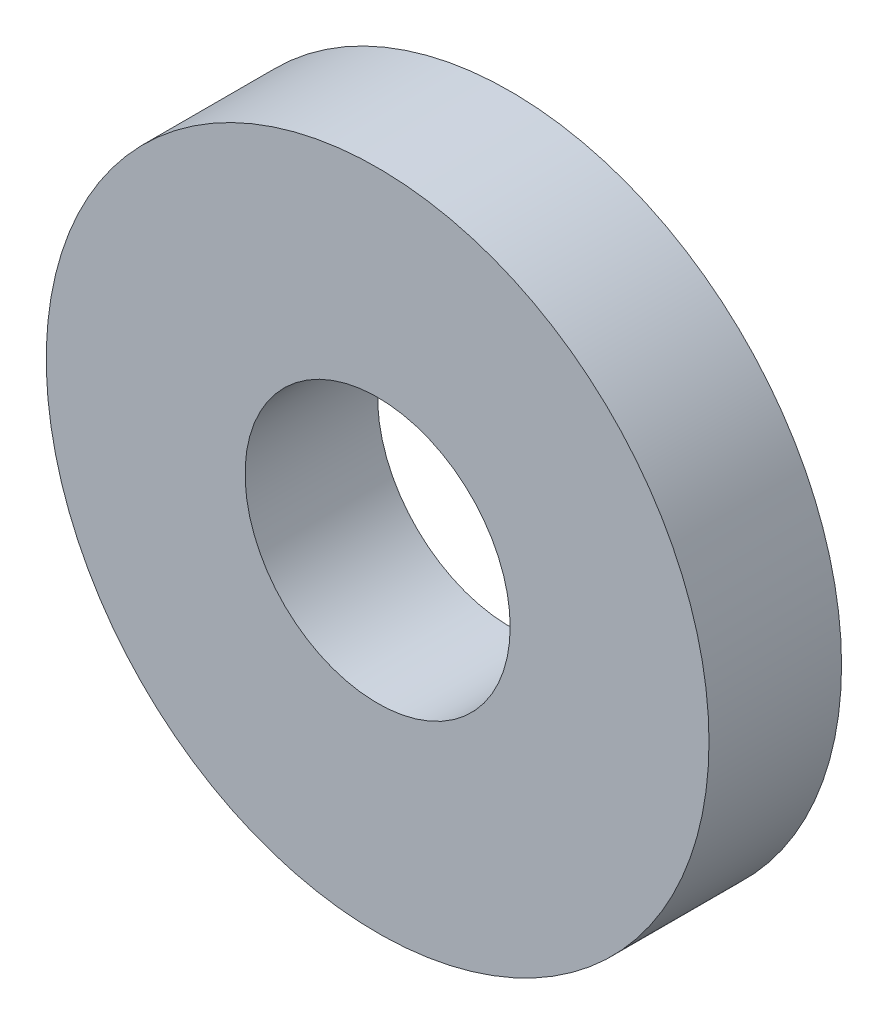
ISO-10303-21;
HEADER;
FILE_DESCRIPTION(('STEP AP214'),'2;1');
FILE_NAME('part.step','',(''),(''),'','','');
FILE_SCHEMA(('AUTOMOTIVE_DESIGN { 1 0 10303 214 1 1 1 1 }'));
ENDSEC;
DATA;
#1=APPLICATION_CONTEXT('core data for automotive mechanical design processes');
#2=APPLICATION_PROTOCOL_DEFINITION('international standard','automotive_design',2000,#1);
#3=PRODUCT_CONTEXT('',#1,'mechanical');
#4=PRODUCT('Part','Part','',(#3));
#5=PRODUCT_RELATED_PRODUCT_CATEGORY('part','',(#4));
#6=PRODUCT_DEFINITION_FORMATION('','',#4);
#7=PRODUCT_DEFINITION_CONTEXT('part definition',#1,'design');
#8=PRODUCT_DEFINITION('design','',#6,#7);
#9=PRODUCT_DEFINITION_SHAPE('','',#8);
#10=(LENGTH_UNIT() NAMED_UNIT(*) SI_UNIT(.MILLI.,.METRE.));
#11=(NAMED_UNIT(*) PLANE_ANGLE_UNIT() SI_UNIT($,.RADIAN.));
#12=(NAMED_UNIT(*) SI_UNIT($,.STERADIAN.) SOLID_ANGLE_UNIT());
#13=UNCERTAINTY_MEASURE_WITH_UNIT(LENGTH_MEASURE(1.E-05),#10,'distance_accuracy_value','');
#14=(GEOMETRIC_REPRESENTATION_CONTEXT(3) GLOBAL_UNCERTAINTY_ASSIGNED_CONTEXT((#13)) GLOBAL_UNIT_ASSIGNED_CONTEXT((#10,
#11,#12)) REPRESENTATION_CONTEXT('',''));
#15=CARTESIAN_POINT('',(0.,0.,0.));
#16=DIRECTION('',(0.,0.,1.));
#17=DIRECTION('',(1.,0.,0.));
#18=AXIS2_PLACEMENT_3D('',#15,#16,#17);
#19=CARTESIAN_POINT('',(0.,0.,5.));
#20=DIRECTION('',(0.,0.,1.));
#21=DIRECTION('',(1.,0.,0.));
#22=AXIS2_PLACEMENT_3D('',#19,#20,#21);
#23=PLANE('',#22);
#24=CARTESIAN_POINT('',(0.,0.,5.));
#25=DIRECTION('',(0.,0.,1.));
#26=DIRECTION('',(1.,0.,0.));
#27=AXIS2_PLACEMENT_3D('',#24,#25,#26);
#28=CIRCLE('',#27,12.5);
#29=CARTESIAN_POINT('',(12.5,0.,5.));
#30=VERTEX_POINT('',#29);
#31=EDGE_CURVE('E10',#30,#30,#28,.T.);
#32=ORIENTED_EDGE('',*,*,#31,.T.);
#33=EDGE_LOOP('',(#32));
#34=FACE_BOUND('',#33,.T.);
#35=CARTESIAN_POINT('',(0.,0.,5.));
#36=DIRECTION('',(0.,0.,1.));
#37=DIRECTION('',(1.,0.,0.));
#38=AXIS2_PLACEMENT_3D('',#35,#36,#37);
#39=CIRCLE('',#38,5.);
#40=CARTESIAN_POINT('',(5.,0.,5.));
#41=VERTEX_POINT('',#40);
#42=EDGE_CURVE('E50',#41,#41,#39,.T.);
#43=ORIENTED_EDGE('',*,*,#42,.F.);
#44=EDGE_LOOP('',(#43));
#45=FACE_BOUND('',#44,.T.);
#46=ADVANCED_FACE('F37',(#34,#45),#23,.T.);
#47=CARTESIAN_POINT('',(0.,0.,0.));
#48=DIRECTION('',(0.,0.,1.));
#49=DIRECTION('',(1.,0.,0.));
#50=AXIS2_PLACEMENT_3D('',#47,#48,#49);
#51=PLANE('',#50);
#52=CARTESIAN_POINT('',(0.,0.,0.));
#53=DIRECTION('',(0.,0.,1.));
#54=DIRECTION('',(1.,0.,0.));
#55=AXIS2_PLACEMENT_3D('',#52,#53,#54);
#56=CIRCLE('',#55,12.5);
#57=CARTESIAN_POINT('',(12.5,0.,0.));
#58=VERTEX_POINT('',#57);
#59=EDGE_CURVE('E41',#58,#58,#56,.T.);
#60=ORIENTED_EDGE('',*,*,#59,.F.);
#61=EDGE_LOOP('',(#60));
#62=FACE_BOUND('',#61,.T.);
#63=CARTESIAN_POINT('',(0.,0.,0.));
#64=DIRECTION('',(0.,0.,1.));
#65=DIRECTION('',(1.,0.,0.));
#66=AXIS2_PLACEMENT_3D('',#63,#64,#65);
#67=CIRCLE('',#66,5.);
#68=CARTESIAN_POINT('',(5.,0.,0.));
#69=VERTEX_POINT('',#68);
#70=EDGE_CURVE('E52',#69,#69,#67,.T.);
#71=ORIENTED_EDGE('',*,*,#70,.T.);
#72=EDGE_LOOP('',(#71));
#73=FACE_BOUND('',#72,.T.);
#74=ADVANCED_FACE('F64',(#62,#73),#51,.F.);
#75=CARTESIAN_POINT('',(0.,0.,5.));
#76=DIRECTION('',(0.,0.,-1.));
#77=DIRECTION('',(-1.,0.,0.));
#78=AXIS2_PLACEMENT_3D('',#75,#76,#77);
#79=CYLINDRICAL_SURFACE('',#78,12.5);
#80=ORIENTED_EDGE('',*,*,#31,.F.);
#81=EDGE_LOOP('',(#80));
#82=FACE_BOUND('',#81,.T.);
#83=ORIENTED_EDGE('',*,*,#59,.T.);
#84=EDGE_LOOP('',(#83));
#85=FACE_BOUND('',#84,.T.);
#86=ADVANCED_FACE('F39',(#82,#85),#79,.T.);
#87=CARTESIAN_POINT('',(0.,0.,5.));
#88=DIRECTION('',(0.,0.,-1.));
#89=DIRECTION('',(-1.,0.,0.));
#90=AXIS2_PLACEMENT_3D('',#87,#88,#89);
#91=CYLINDRICAL_SURFACE('',#90,5.);
#92=ORIENTED_EDGE('',*,*,#42,.T.);
#93=EDGE_LOOP('',(#92));
#94=FACE_BOUND('',#93,.T.);
#95=ORIENTED_EDGE('',*,*,#70,.F.);
#96=EDGE_LOOP('',(#95));
#97=FACE_BOUND('',#96,.T.);
#98=ADVANCED_FACE('F60',(#94,#97),#91,.F.);
#99=CLOSED_SHELL('',(#46,#74,#86,#98));
#100=MANIFOLD_SOLID_BREP('B2',#99);
#101=ADVANCED_BREP_SHAPE_REPRESENTATION('',(#18,#100),#14);
#102=SHAPE_DEFINITION_REPRESENTATION(#9,#101);
ENDSEC;
END-ISO-10303-21;
